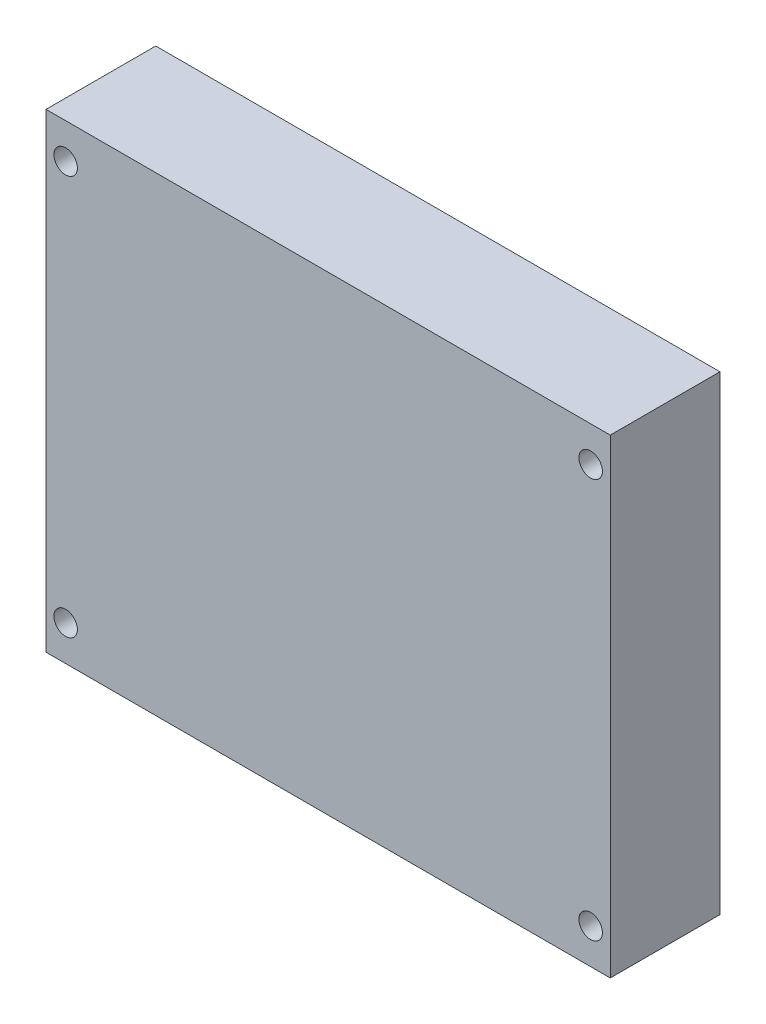
ISO-10303-21;
HEADER;
FILE_DESCRIPTION(('STEP AP214'),'2;1');
FILE_NAME('part.step','',(''),(''),'','','');
FILE_SCHEMA(('AUTOMOTIVE_DESIGN { 1 0 10303 214 1 1 1 1 }'));
ENDSEC;
DATA;
#1=APPLICATION_CONTEXT('core data for automotive mechanical design processes');
#2=APPLICATION_PROTOCOL_DEFINITION('international standard','automotive_design',2000,#1);
#3=PRODUCT_CONTEXT('',#1,'mechanical');
#4=PRODUCT('Part','Part','',(#3));
#5=PRODUCT_RELATED_PRODUCT_CATEGORY('part','',(#4));
#6=PRODUCT_DEFINITION_FORMATION('','',#4);
#7=PRODUCT_DEFINITION_CONTEXT('part definition',#1,'design');
#8=PRODUCT_DEFINITION('design','',#6,#7);
#9=PRODUCT_DEFINITION_SHAPE('','',#8);
#10=(LENGTH_UNIT() NAMED_UNIT(*) SI_UNIT(.MILLI.,.METRE.));
#11=(NAMED_UNIT(*) PLANE_ANGLE_UNIT() SI_UNIT($,.RADIAN.));
#12=(NAMED_UNIT(*) SI_UNIT($,.STERADIAN.) SOLID_ANGLE_UNIT());
#13=UNCERTAINTY_MEASURE_WITH_UNIT(LENGTH_MEASURE(1.E-05),#10,'distance_accuracy_value','');
#14=(GEOMETRIC_REPRESENTATION_CONTEXT(3) GLOBAL_UNCERTAINTY_ASSIGNED_CONTEXT((#13)) GLOBAL_UNIT_ASSIGNED_CONTEXT((#10,
#11,#12)) REPRESENTATION_CONTEXT('',''));
#15=CARTESIAN_POINT('',(0.,0.,0.));
#16=DIRECTION('',(0.,0.,1.));
#17=DIRECTION('',(1.,0.,0.));
#18=AXIS2_PLACEMENT_3D('',#15,#16,#17);
#19=CARTESIAN_POINT('',(0.,0.,14.));
#20=DIRECTION('',(0.,0.,-1.));
#21=DIRECTION('',(-1.,0.,0.));
#22=AXIS2_PLACEMENT_3D('',#19,#20,#21);
#23=PLANE('',#22);
#24=DIRECTION('',(0.,-1.,0.));
#25=VECTOR('',#24,1.);
#26=CARTESIAN_POINT('',(0.,0.,14.));
#27=LINE('',#26,#25);
#28=CARTESIAN_POINT('',(0.,60.,14.));
#29=VERTEX_POINT('',#28);
#30=CARTESIAN_POINT('',(0.,0.,14.));
#31=VERTEX_POINT('',#30);
#32=EDGE_CURVE('E85',#29,#31,#27,.T.);
#33=ORIENTED_EDGE('',*,*,#32,.T.);
#34=DIRECTION('',(1.,0.,0.));
#35=VECTOR('',#34,1.);
#36=CARTESIAN_POINT('',(0.,0.,14.));
#37=LINE('',#36,#35);
#38=CARTESIAN_POINT('',(72.,0.,14.));
#39=VERTEX_POINT('',#38);
#40=EDGE_CURVE('E80',#31,#39,#37,.T.);
#41=ORIENTED_EDGE('',*,*,#40,.T.);
#42=DIRECTION('',(0.,1.,0.));
#43=VECTOR('',#42,1.);
#44=CARTESIAN_POINT('',(72.,0.,14.));
#45=LINE('',#44,#43);
#46=CARTESIAN_POINT('',(72.,60.,14.));
#47=VERTEX_POINT('',#46);
#48=EDGE_CURVE('E83',#39,#47,#45,.T.);
#49=ORIENTED_EDGE('',*,*,#48,.T.);
#50=DIRECTION('',(-1.,0.,0.));
#51=VECTOR('',#50,1.);
#52=CARTESIAN_POINT('',(0.,60.,14.));
#53=LINE('',#52,#51);
#54=EDGE_CURVE('E50',#47,#29,#53,.T.);
#55=ORIENTED_EDGE('',*,*,#54,.T.);
#56=EDGE_LOOP('',(#33,#41,#49,#55));
#57=FACE_BOUND('',#56,.T.);
#58=CARTESIAN_POINT('',(2.5,55.5,14.));
#59=DIRECTION('',(0.,0.,1.));
#60=DIRECTION('',(1.,0.,0.));
#61=AXIS2_PLACEMENT_3D('',#58,#59,#60);
#62=CIRCLE('',#61,1.5);
#63=CARTESIAN_POINT('',(4.,55.5,14.));
#64=VERTEX_POINT('',#63);
#65=EDGE_CURVE('E100',#64,#64,#62,.T.);
#66=ORIENTED_EDGE('',*,*,#65,.F.);
#67=EDGE_LOOP('',(#66));
#68=FACE_BOUND('',#67,.T.);
#69=CARTESIAN_POINT('',(69.5,55.5,14.));
#70=DIRECTION('',(0.,0.,1.));
#71=DIRECTION('',(1.,0.,0.));
#72=AXIS2_PLACEMENT_3D('',#69,#70,#71);
#73=CIRCLE('',#72,1.5);
#74=CARTESIAN_POINT('',(71.,55.5,14.));
#75=VERTEX_POINT('',#74);
#76=EDGE_CURVE('E115',#75,#75,#73,.T.);
#77=ORIENTED_EDGE('',*,*,#76,.F.);
#78=EDGE_LOOP('',(#77));
#79=FACE_BOUND('',#78,.T.);
#80=CARTESIAN_POINT('',(69.5,4.5,14.));
#81=DIRECTION('',(0.,0.,1.));
#82=DIRECTION('',(1.,0.,0.));
#83=AXIS2_PLACEMENT_3D('',#80,#81,#82);
#84=CIRCLE('',#83,1.5);
#85=CARTESIAN_POINT('',(71.,4.5,14.));
#86=VERTEX_POINT('',#85);
#87=EDGE_CURVE('E121',#86,#86,#84,.T.);
#88=ORIENTED_EDGE('',*,*,#87,.F.);
#89=EDGE_LOOP('',(#88));
#90=FACE_BOUND('',#89,.T.);
#91=CARTESIAN_POINT('',(2.50000000000001,4.5,14.));
#92=DIRECTION('',(0.,0.,1.));
#93=DIRECTION('',(1.,0.,0.));
#94=AXIS2_PLACEMENT_3D('',#91,#92,#93);
#95=CIRCLE('',#94,1.5);
#96=CARTESIAN_POINT('',(4.00000000000001,4.5,14.));
#97=VERTEX_POINT('',#96);
#98=EDGE_CURVE('E127',#97,#97,#95,.T.);
#99=ORIENTED_EDGE('',*,*,#98,.F.);
#100=EDGE_LOOP('',(#99));
#101=FACE_BOUND('',#100,.T.);
#102=ADVANCED_FACE('F33',(#57,#68,#79,#90,#101),#23,.F.);
#103=CARTESIAN_POINT('',(0.,0.,0.));
#104=DIRECTION('',(0.,0.,-1.));
#105=DIRECTION('',(-1.,0.,0.));
#106=AXIS2_PLACEMENT_3D('',#103,#104,#105);
#107=PLANE('',#106);
#108=CARTESIAN_POINT('',(69.5,4.5,0.));
#109=DIRECTION('',(0.,0.,1.));
#110=DIRECTION('',(1.,0.,0.));
#111=AXIS2_PLACEMENT_3D('',#108,#109,#110);
#112=CIRCLE('',#111,1.5);
#113=CARTESIAN_POINT('',(71.,4.5,0.));
#114=VERTEX_POINT('',#113);
#115=EDGE_CURVE('E124',#114,#114,#112,.T.);
#116=ORIENTED_EDGE('',*,*,#115,.T.);
#117=EDGE_LOOP('',(#116));
#118=FACE_BOUND('',#117,.T.);
#119=CARTESIAN_POINT('',(2.5,55.5,0.));
#120=DIRECTION('',(0.,0.,1.));
#121=DIRECTION('',(1.,0.,0.));
#122=AXIS2_PLACEMENT_3D('',#119,#120,#121);
#123=CIRCLE('',#122,1.5);
#124=CARTESIAN_POINT('',(4.,55.5,0.));
#125=VERTEX_POINT('',#124);
#126=EDGE_CURVE('E112',#125,#125,#123,.T.);
#127=ORIENTED_EDGE('',*,*,#126,.T.);
#128=EDGE_LOOP('',(#127));
#129=FACE_BOUND('',#128,.T.);
#130=DIRECTION('',(0.,-1.,0.));
#131=VECTOR('',#130,1.);
#132=CARTESIAN_POINT('',(0.,0.,0.));
#133=LINE('',#132,#131);
#134=CARTESIAN_POINT('',(0.,60.,0.));
#135=VERTEX_POINT('',#134);
#136=CARTESIAN_POINT('',(0.,0.,0.));
#137=VERTEX_POINT('',#136);
#138=EDGE_CURVE('E97',#135,#137,#133,.T.);
#139=ORIENTED_EDGE('',*,*,#138,.F.);
#140=DIRECTION('',(-1.,0.,0.));
#141=VECTOR('',#140,1.);
#142=CARTESIAN_POINT('',(0.,60.,0.));
#143=LINE('',#142,#141);
#144=CARTESIAN_POINT('',(72.,60.,0.));
#145=VERTEX_POINT('',#144);
#146=EDGE_CURVE('E73',#145,#135,#143,.T.);
#147=ORIENTED_EDGE('',*,*,#146,.F.);
#148=DIRECTION('',(0.,1.,0.));
#149=VECTOR('',#148,1.);
#150=CARTESIAN_POINT('',(72.,0.,0.));
#151=LINE('',#150,#149);
#152=CARTESIAN_POINT('',(72.,0.,0.));
#153=VERTEX_POINT('',#152);
#154=EDGE_CURVE('E67',#153,#145,#151,.T.);
#155=ORIENTED_EDGE('',*,*,#154,.F.);
#156=DIRECTION('',(1.,0.,0.));
#157=VECTOR('',#156,1.);
#158=CARTESIAN_POINT('',(0.,0.,0.));
#159=LINE('',#158,#157);
#160=EDGE_CURVE('E89',#137,#153,#159,.T.);
#161=ORIENTED_EDGE('',*,*,#160,.F.);
#162=EDGE_LOOP('',(#139,#147,#155,#161));
#163=FACE_BOUND('',#162,.T.);
#164=CARTESIAN_POINT('',(69.5,55.5,0.));
#165=DIRECTION('',(0.,0.,1.));
#166=DIRECTION('',(1.,0.,0.));
#167=AXIS2_PLACEMENT_3D('',#164,#165,#166);
#168=CIRCLE('',#167,1.5);
#169=CARTESIAN_POINT('',(71.,55.5,0.));
#170=VERTEX_POINT('',#169);
#171=EDGE_CURVE('E118',#170,#170,#168,.T.);
#172=ORIENTED_EDGE('',*,*,#171,.T.);
#173=EDGE_LOOP('',(#172));
#174=FACE_BOUND('',#173,.T.);
#175=CARTESIAN_POINT('',(2.50000000000001,4.5,0.));
#176=DIRECTION('',(0.,0.,1.));
#177=DIRECTION('',(1.,0.,0.));
#178=AXIS2_PLACEMENT_3D('',#175,#176,#177);
#179=CIRCLE('',#178,1.5);
#180=CARTESIAN_POINT('',(4.00000000000001,4.5,0.));
#181=VERTEX_POINT('',#180);
#182=EDGE_CURVE('E130',#181,#181,#179,.T.);
#183=ORIENTED_EDGE('',*,*,#182,.T.);
#184=EDGE_LOOP('',(#183));
#185=FACE_BOUND('',#184,.T.);
#186=ADVANCED_FACE('F108',(#118,#129,#163,#174,#185),#107,.T.);
#187=CARTESIAN_POINT('',(0.,0.,14.));
#188=DIRECTION('',(1.,0.,0.));
#189=DIRECTION('',(0.,0.,-1.));
#190=AXIS2_PLACEMENT_3D('',#187,#188,#189);
#191=PLANE('',#190);
#192=ORIENTED_EDGE('',*,*,#138,.T.);
#193=DIRECTION('',(0.,0.,-1.));
#194=VECTOR('',#193,1.);
#195=CARTESIAN_POINT('',(0.,0.,14.));
#196=LINE('',#195,#194);
#197=EDGE_CURVE('E11',#31,#137,#196,.T.);
#198=ORIENTED_EDGE('',*,*,#197,.F.);
#199=ORIENTED_EDGE('',*,*,#32,.F.);
#200=DIRECTION('',(0.,0.,-1.));
#201=VECTOR('',#200,1.);
#202=CARTESIAN_POINT('',(0.,60.,14.));
#203=LINE('',#202,#201);
#204=EDGE_CURVE('E93',#29,#135,#203,.T.);
#205=ORIENTED_EDGE('',*,*,#204,.T.);
#206=EDGE_LOOP('',(#192,#198,#199,#205));
#207=FACE_BOUND('',#206,.T.);
#208=ADVANCED_FACE('F35',(#207),#191,.F.);
#209=CARTESIAN_POINT('',(0.,0.,14.));
#210=DIRECTION('',(0.,1.,0.));
#211=DIRECTION('',(0.,0.,1.));
#212=AXIS2_PLACEMENT_3D('',#209,#210,#211);
#213=PLANE('',#212);
#214=ORIENTED_EDGE('',*,*,#160,.T.);
#215=DIRECTION('',(0.,0.,-1.));
#216=VECTOR('',#215,1.);
#217=CARTESIAN_POINT('',(72.,0.,14.));
#218=LINE('',#217,#216);
#219=EDGE_CURVE('E42',#39,#153,#218,.T.);
#220=ORIENTED_EDGE('',*,*,#219,.F.);
#221=ORIENTED_EDGE('',*,*,#40,.F.);
#222=ORIENTED_EDGE('',*,*,#197,.T.);
#223=EDGE_LOOP('',(#214,#220,#221,#222));
#224=FACE_BOUND('',#223,.T.);
#225=ADVANCED_FACE('F88',(#224),#213,.F.);
#226=CARTESIAN_POINT('',(72.,0.,14.));
#227=DIRECTION('',(-1.,0.,0.));
#228=DIRECTION('',(0.,-1.,0.));
#229=AXIS2_PLACEMENT_3D('',#226,#227,#228);
#230=PLANE('',#229);
#231=ORIENTED_EDGE('',*,*,#154,.T.);
#232=DIRECTION('',(0.,0.,-1.));
#233=VECTOR('',#232,1.);
#234=CARTESIAN_POINT('',(72.,60.,14.));
#235=LINE('',#234,#233);
#236=EDGE_CURVE('E90',#47,#145,#235,.T.);
#237=ORIENTED_EDGE('',*,*,#236,.F.);
#238=ORIENTED_EDGE('',*,*,#48,.F.);
#239=ORIENTED_EDGE('',*,*,#219,.T.);
#240=EDGE_LOOP('',(#231,#237,#238,#239));
#241=FACE_BOUND('',#240,.T.);
#242=ADVANCED_FACE('F91',(#241),#230,.F.);
#243=CARTESIAN_POINT('',(0.,60.,14.));
#244=DIRECTION('',(0.,-1.,0.));
#245=DIRECTION('',(0.,0.,-1.));
#246=AXIS2_PLACEMENT_3D('',#243,#244,#245);
#247=PLANE('',#246);
#248=ORIENTED_EDGE('',*,*,#146,.T.);
#249=ORIENTED_EDGE('',*,*,#204,.F.);
#250=ORIENTED_EDGE('',*,*,#54,.F.);
#251=ORIENTED_EDGE('',*,*,#236,.T.);
#252=EDGE_LOOP('',(#248,#249,#250,#251));
#253=FACE_BOUND('',#252,.T.);
#254=ADVANCED_FACE('F105',(#253),#247,.F.);
#255=CARTESIAN_POINT('',(2.5,55.5,14.));
#256=DIRECTION('',(0.,0.,-1.));
#257=DIRECTION('',(-1.,0.,0.));
#258=AXIS2_PLACEMENT_3D('',#255,#256,#257);
#259=CYLINDRICAL_SURFACE('',#258,1.5);
#260=ORIENTED_EDGE('',*,*,#65,.T.);
#261=EDGE_LOOP('',(#260));
#262=FACE_BOUND('',#261,.T.);
#263=ORIENTED_EDGE('',*,*,#126,.F.);
#264=EDGE_LOOP('',(#263));
#265=FACE_BOUND('',#264,.T.);
#266=ADVANCED_FACE('F147',(#262,#265),#259,.F.);
#267=CARTESIAN_POINT('',(69.5,55.5,14.));
#268=DIRECTION('',(0.,0.,-1.));
#269=DIRECTION('',(-1.,0.,0.));
#270=AXIS2_PLACEMENT_3D('',#267,#268,#269);
#271=CYLINDRICAL_SURFACE('',#270,1.5);
#272=ORIENTED_EDGE('',*,*,#76,.T.);
#273=EDGE_LOOP('',(#272));
#274=FACE_BOUND('',#273,.T.);
#275=ORIENTED_EDGE('',*,*,#171,.F.);
#276=EDGE_LOOP('',(#275));
#277=FACE_BOUND('',#276,.T.);
#278=ADVANCED_FACE('F193',(#274,#277),#271,.F.);
#279=CARTESIAN_POINT('',(69.5,4.5,14.));
#280=DIRECTION('',(0.,0.,-1.));
#281=DIRECTION('',(-1.,0.,0.));
#282=AXIS2_PLACEMENT_3D('',#279,#280,#281);
#283=CYLINDRICAL_SURFACE('',#282,1.5);
#284=ORIENTED_EDGE('',*,*,#87,.T.);
#285=EDGE_LOOP('',(#284));
#286=FACE_BOUND('',#285,.T.);
#287=ORIENTED_EDGE('',*,*,#115,.F.);
#288=EDGE_LOOP('',(#287));
#289=FACE_BOUND('',#288,.T.);
#290=ADVANCED_FACE('F201',(#286,#289),#283,.F.);
#291=CARTESIAN_POINT('',(2.50000000000001,4.5,14.));
#292=DIRECTION('',(0.,0.,-1.));
#293=DIRECTION('',(-1.,0.,0.));
#294=AXIS2_PLACEMENT_3D('',#291,#292,#293);
#295=CYLINDRICAL_SURFACE('',#294,1.5);
#296=ORIENTED_EDGE('',*,*,#98,.T.);
#297=EDGE_LOOP('',(#296));
#298=FACE_BOUND('',#297,.T.);
#299=ORIENTED_EDGE('',*,*,#182,.F.);
#300=EDGE_LOOP('',(#299));
#301=FACE_BOUND('',#300,.T.);
#302=ADVANCED_FACE('F136',(#298,#301),#295,.F.);
#303=CLOSED_SHELL('',(#102,#186,#208,#225,#242,#254,#266,#278,#290,#302));
#304=MANIFOLD_SOLID_BREP('B2',#303);
#305=ADVANCED_BREP_SHAPE_REPRESENTATION('',(#18,#304),#14);
#306=SHAPE_DEFINITION_REPRESENTATION(#9,#305);
ENDSEC;
END-ISO-10303-21;
